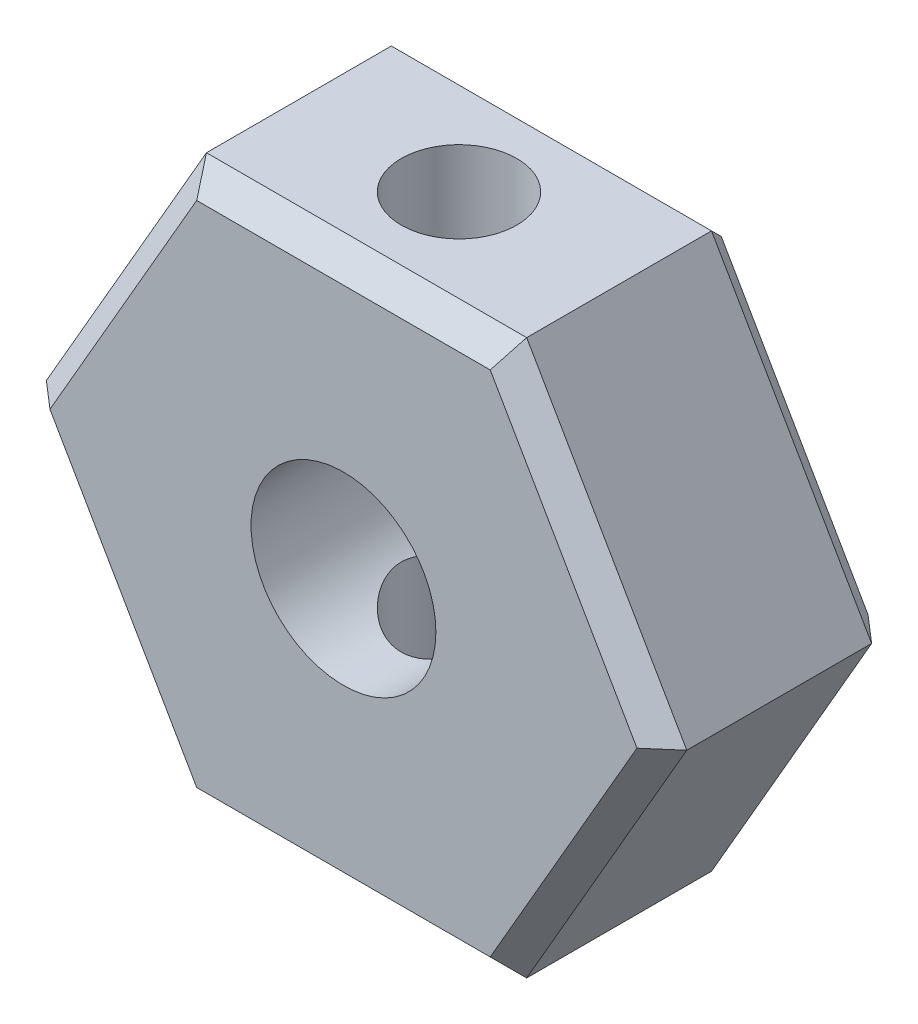
ISO-10303-21;
HEADER;
FILE_DESCRIPTION(('STEP AP214'),'2;1');
FILE_NAME('part.step','',(''),(''),'','','');
FILE_SCHEMA(('AUTOMOTIVE_DESIGN { 1 0 10303 214 1 1 1 1 }'));
ENDSEC;
DATA;
#1=APPLICATION_CONTEXT('core data for automotive mechanical design processes');
#2=APPLICATION_PROTOCOL_DEFINITION('international standard','automotive_design',2000,#1);
#3=PRODUCT_CONTEXT('',#1,'mechanical');
#4=PRODUCT('Part','Part','',(#3));
#5=PRODUCT_RELATED_PRODUCT_CATEGORY('part','',(#4));
#6=PRODUCT_DEFINITION_FORMATION('','',#4);
#7=PRODUCT_DEFINITION_CONTEXT('part definition',#1,'design');
#8=PRODUCT_DEFINITION('design','',#6,#7);
#9=PRODUCT_DEFINITION_SHAPE('','',#8);
#10=(LENGTH_UNIT() NAMED_UNIT(*) SI_UNIT(.MILLI.,.METRE.));
#11=(NAMED_UNIT(*) PLANE_ANGLE_UNIT() SI_UNIT($,.RADIAN.));
#12=(NAMED_UNIT(*) SI_UNIT($,.STERADIAN.) SOLID_ANGLE_UNIT());
#13=UNCERTAINTY_MEASURE_WITH_UNIT(LENGTH_MEASURE(1.E-05),#10,'distance_accuracy_value','');
#14=(GEOMETRIC_REPRESENTATION_CONTEXT(3) GLOBAL_UNCERTAINTY_ASSIGNED_CONTEXT((#13)) GLOBAL_UNIT_ASSIGNED_CONTEXT((#10,
#11,#12)) REPRESENTATION_CONTEXT('',''));
#15=CARTESIAN_POINT('',(0.,0.,0.));
#16=DIRECTION('',(0.,0.,1.));
#17=DIRECTION('',(1.,0.,0.));
#18=AXIS2_PLACEMENT_3D('',#15,#16,#17);
#19=CARTESIAN_POINT('',(3.46410161513776,-6.,5.));
#20=DIRECTION('',(-0.866025403784439,0.5,0.));
#21=DIRECTION('',(-0.5,-0.866025403784439,0.));
#22=AXIS2_PLACEMENT_3D('',#19,#20,#21);
#23=PLANE('',#22);
#24=DIRECTION('',(0.,0.,-1.));
#25=VECTOR('',#24,1.);
#26=CARTESIAN_POINT('',(3.46410161513776,-6.,5.));
#27=LINE('',#26,#25);
#28=CARTESIAN_POINT('',(3.46410161513776,-6.,4.49999999999999));
#29=VERTEX_POINT('',#28);
#30=CARTESIAN_POINT('',(3.46410161513776,-6.,0.499999999999998));
#31=VERTEX_POINT('',#30);
#32=EDGE_CURVE('E150',#29,#31,#27,.T.);
#33=ORIENTED_EDGE('',*,*,#32,.T.);
#34=DIRECTION('',(0.5,0.866025403784439,0.));
#35=VECTOR('',#34,1.);
#36=CARTESIAN_POINT('',(3.46410161513776,-6.,0.499999999999998));
#37=LINE('',#36,#35);
#38=CARTESIAN_POINT('',(6.92820323027551,0.,0.499999999999996));
#39=VERTEX_POINT('',#38);
#40=EDGE_CURVE('E152',#31,#39,#37,.T.);
#41=ORIENTED_EDGE('',*,*,#40,.T.);
#42=DIRECTION('',(0.,0.,-1.));
#43=VECTOR('',#42,1.);
#44=CARTESIAN_POINT('',(6.92820323027551,0.,5.));
#45=LINE('',#44,#43);
#46=CARTESIAN_POINT('',(6.92820323027551,0.,4.49999999999999));
#47=VERTEX_POINT('',#46);
#48=EDGE_CURVE('E145',#47,#39,#45,.T.);
#49=ORIENTED_EDGE('',*,*,#48,.F.);
#50=DIRECTION('',(-0.5,-0.866025403784439,0.));
#51=VECTOR('',#50,1.);
#52=CARTESIAN_POINT('',(3.46410161513776,-6.,4.49999999999999));
#53=LINE('',#52,#51);
#54=EDGE_CURVE('E130',#47,#29,#53,.T.);
#55=ORIENTED_EDGE('',*,*,#54,.T.);
#56=EDGE_LOOP('',(#33,#41,#49,#55));
#57=FACE_BOUND('',#56,.T.);
#58=ADVANCED_FACE('F33',(#57),#23,.F.);
#59=CARTESIAN_POINT('',(6.92820323027551,0.,5.));
#60=DIRECTION('',(-0.866025403784439,-0.5,0.));
#61=DIRECTION('',(0.5,-0.866025403784439,0.));
#62=AXIS2_PLACEMENT_3D('',#59,#60,#61);
#63=PLANE('',#62);
#64=ORIENTED_EDGE('',*,*,#48,.T.);
#65=DIRECTION('',(-0.5,0.866025403784439,0.));
#66=VECTOR('',#65,1.);
#67=CARTESIAN_POINT('',(6.92820323027551,0.,0.499999999999996));
#68=LINE('',#67,#66);
#69=CARTESIAN_POINT('',(3.46410161513776,6.,0.499999999999996));
#70=VERTEX_POINT('',#69);
#71=EDGE_CURVE('E205',#39,#70,#68,.T.);
#72=ORIENTED_EDGE('',*,*,#71,.T.);
#73=DIRECTION('',(0.,0.,-1.));
#74=VECTOR('',#73,1.);
#75=CARTESIAN_POINT('',(3.46410161513776,6.,5.));
#76=LINE('',#75,#74);
#77=CARTESIAN_POINT('',(3.46410161513776,6.,4.49999999999999));
#78=VERTEX_POINT('',#77);
#79=EDGE_CURVE('E173',#78,#70,#76,.T.);
#80=ORIENTED_EDGE('',*,*,#79,.F.);
#81=DIRECTION('',(0.5,-0.866025403784439,0.));
#82=VECTOR('',#81,1.);
#83=CARTESIAN_POINT('',(6.92820323027551,0.,4.49999999999999));
#84=LINE('',#83,#82);
#85=EDGE_CURVE('E203',#78,#47,#84,.T.);
#86=ORIENTED_EDGE('',*,*,#85,.T.);
#87=EDGE_LOOP('',(#64,#72,#80,#86));
#88=FACE_BOUND('',#87,.T.);
#89=ADVANCED_FACE('F261',(#88),#63,.F.);
#90=CARTESIAN_POINT('',(3.46410161513776,6.,5.));
#91=DIRECTION('',(0.,-1.,0.));
#92=DIRECTION('',(1.,0.,0.));
#93=AXIS2_PLACEMENT_3D('',#90,#91,#92);
#94=PLANE('',#93);
#95=CARTESIAN_POINT('',(0.,6.,2.5));
#96=DIRECTION('',(0.,1.,0.));
#97=DIRECTION('',(-1.,0.,0.));
#98=AXIS2_PLACEMENT_3D('',#95,#96,#97);
#99=CIRCLE('',#98,1.25);
#100=CARTESIAN_POINT('',(-1.25,6.,2.5));
#101=VERTEX_POINT('',#100);
#102=EDGE_CURVE('E385',#101,#101,#99,.T.);
#103=ORIENTED_EDGE('',*,*,#102,.F.);
#104=EDGE_LOOP('',(#103));
#105=FACE_BOUND('',#104,.T.);
#106=ORIENTED_EDGE('',*,*,#79,.T.);
#107=DIRECTION('',(-1.,0.,0.));
#108=VECTOR('',#107,1.);
#109=CARTESIAN_POINT('',(3.46410161513776,6.,0.499999999999997));
#110=LINE('',#109,#108);
#111=CARTESIAN_POINT('',(-3.46410161513776,6.,0.499999999999997));
#112=VERTEX_POINT('',#111);
#113=EDGE_CURVE('E201',#70,#112,#110,.T.);
#114=ORIENTED_EDGE('',*,*,#113,.T.);
#115=DIRECTION('',(0.,0.,-1.));
#116=VECTOR('',#115,1.);
#117=CARTESIAN_POINT('',(-3.46410161513776,6.,5.));
#118=LINE('',#117,#116);
#119=CARTESIAN_POINT('',(-3.46410161513776,6.,4.49999999999999));
#120=VERTEX_POINT('',#119);
#121=EDGE_CURVE('E170',#120,#112,#118,.T.);
#122=ORIENTED_EDGE('',*,*,#121,.F.);
#123=DIRECTION('',(1.,0.,0.));
#124=VECTOR('',#123,1.);
#125=CARTESIAN_POINT('',(3.46410161513776,6.,4.49999999999999));
#126=LINE('',#125,#124);
#127=EDGE_CURVE('E199',#120,#78,#126,.T.);
#128=ORIENTED_EDGE('',*,*,#127,.T.);
#129=EDGE_LOOP('',(#106,#114,#122,#128));
#130=FACE_BOUND('',#129,.T.);
#131=ADVANCED_FACE('F266',(#105,#130),#94,.F.);
#132=CARTESIAN_POINT('',(-3.46410161513776,6.,5.));
#133=DIRECTION('',(0.866025403784439,-0.5,0.));
#134=DIRECTION('',(0.5,0.866025403784439,0.));
#135=AXIS2_PLACEMENT_3D('',#132,#133,#134);
#136=PLANE('',#135);
#137=ORIENTED_EDGE('',*,*,#121,.T.);
#138=DIRECTION('',(-0.5,-0.866025403784439,0.));
#139=VECTOR('',#138,1.);
#140=CARTESIAN_POINT('',(-3.46410161513776,6.,0.499999999999997));
#141=LINE('',#140,#139);
#142=CARTESIAN_POINT('',(-6.92820323027551,0.,0.499999999999997));
#143=VERTEX_POINT('',#142);
#144=EDGE_CURVE('E197',#112,#143,#141,.T.);
#145=ORIENTED_EDGE('',*,*,#144,.T.);
#146=DIRECTION('',(0.,0.,-1.));
#147=VECTOR('',#146,1.);
#148=CARTESIAN_POINT('',(-6.92820323027551,0.,5.));
#149=LINE('',#148,#147);
#150=CARTESIAN_POINT('',(-6.92820323027551,0.,4.49999999999999));
#151=VERTEX_POINT('',#150);
#152=EDGE_CURVE('E161',#151,#143,#149,.T.);
#153=ORIENTED_EDGE('',*,*,#152,.F.);
#154=DIRECTION('',(0.5,0.866025403784439,0.));
#155=VECTOR('',#154,1.);
#156=CARTESIAN_POINT('',(-3.46410161513776,6.,4.49999999999999));
#157=LINE('',#156,#155);
#158=EDGE_CURVE('E195',#151,#120,#157,.T.);
#159=ORIENTED_EDGE('',*,*,#158,.T.);
#160=EDGE_LOOP('',(#137,#145,#153,#159));
#161=FACE_BOUND('',#160,.T.);
#162=ADVANCED_FACE('F322',(#161),#136,.F.);
#163=CARTESIAN_POINT('',(-6.92820323027551,0.,5.));
#164=DIRECTION('',(0.866025403784438,0.5,0.));
#165=DIRECTION('',(-0.5,0.866025403784439,0.));
#166=AXIS2_PLACEMENT_3D('',#163,#164,#165);
#167=PLANE('',#166);
#168=ORIENTED_EDGE('',*,*,#152,.T.);
#169=DIRECTION('',(0.5,-0.866025403784439,0.));
#170=VECTOR('',#169,1.);
#171=CARTESIAN_POINT('',(-6.92820323027551,0.,0.499999999999998));
#172=LINE('',#171,#170);
#173=CARTESIAN_POINT('',(-3.46410161513775,-6.,0.499999999999998));
#174=VERTEX_POINT('',#173);
#175=EDGE_CURVE('E193',#143,#174,#172,.T.);
#176=ORIENTED_EDGE('',*,*,#175,.T.);
#177=DIRECTION('',(0.,0.,-1.));
#178=VECTOR('',#177,1.);
#179=CARTESIAN_POINT('',(-3.46410161513775,-6.,5.));
#180=LINE('',#179,#178);
#181=CARTESIAN_POINT('',(-3.46410161513775,-6.,4.49999999999999));
#182=VERTEX_POINT('',#181);
#183=EDGE_CURVE('E158',#182,#174,#180,.T.);
#184=ORIENTED_EDGE('',*,*,#183,.F.);
#185=DIRECTION('',(-0.5,0.866025403784439,0.));
#186=VECTOR('',#185,1.);
#187=CARTESIAN_POINT('',(-6.92820323027551,0.,4.49999999999999));
#188=LINE('',#187,#186);
#189=EDGE_CURVE('E191',#182,#151,#188,.T.);
#190=ORIENTED_EDGE('',*,*,#189,.T.);
#191=EDGE_LOOP('',(#168,#176,#184,#190));
#192=FACE_BOUND('',#191,.T.);
#193=ADVANCED_FACE('F342',(#192),#167,.F.);
#194=CARTESIAN_POINT('',(-3.46410161513775,-6.,5.));
#195=DIRECTION('',(0.,1.,0.));
#196=DIRECTION('',(0.,0.,1.));
#197=AXIS2_PLACEMENT_3D('',#194,#195,#196);
#198=PLANE('',#197);
#199=CARTESIAN_POINT('',(0.,-6.00000000000001,2.5));
#200=DIRECTION('',(0.,1.,0.));
#201=DIRECTION('',(-1.,0.,0.));
#202=AXIS2_PLACEMENT_3D('',#199,#200,#201);
#203=CIRCLE('',#202,1.25);
#204=CARTESIAN_POINT('',(-1.25,-6.00000000000001,2.5));
#205=VERTEX_POINT('',#204);
#206=EDGE_CURVE('E244',#205,#205,#203,.T.);
#207=ORIENTED_EDGE('',*,*,#206,.T.);
#208=EDGE_LOOP('',(#207));
#209=FACE_BOUND('',#208,.T.);
#210=ORIENTED_EDGE('',*,*,#183,.T.);
#211=DIRECTION('',(1.,0.,0.));
#212=VECTOR('',#211,1.);
#213=CARTESIAN_POINT('',(-3.46410161513775,-6.,0.499999999999997));
#214=LINE('',#213,#212);
#215=EDGE_CURVE('E144',#174,#31,#214,.T.);
#216=ORIENTED_EDGE('',*,*,#215,.T.);
#217=ORIENTED_EDGE('',*,*,#32,.F.);
#218=DIRECTION('',(-1.,0.,0.));
#219=VECTOR('',#218,1.);
#220=CARTESIAN_POINT('',(-3.46410161513775,-6.,4.49999999999999));
#221=LINE('',#220,#219);
#222=EDGE_CURVE('E137',#29,#182,#221,.T.);
#223=ORIENTED_EDGE('',*,*,#222,.T.);
#224=EDGE_LOOP('',(#210,#216,#217,#223));
#225=FACE_BOUND('',#224,.T.);
#226=ADVANCED_FACE('F156',(#209,#225),#198,.F.);
#227=CARTESIAN_POINT('',(0.,0.,5.));
#228=DIRECTION('',(0.,0.,1.));
#229=DIRECTION('',(1.,0.,0.));
#230=AXIS2_PLACEMENT_3D('',#227,#228,#229);
#231=PLANE('',#230);
#232=DIRECTION('',(1.,0.,0.));
#233=VECTOR('',#232,1.);
#234=CARTESIAN_POINT('',(3.46410161513776,-5.5,5.));
#235=LINE('',#234,#233);
#236=CARTESIAN_POINT('',(-3.17542648054294,-5.5,5.));
#237=VERTEX_POINT('',#236);
#238=CARTESIAN_POINT('',(3.17542648054294,-5.5,5.));
#239=VERTEX_POINT('',#238);
#240=EDGE_CURVE('E46',#237,#239,#235,.T.);
#241=ORIENTED_EDGE('',*,*,#240,.T.);
#242=DIRECTION('',(0.5,0.866025403784439,0.));
#243=VECTOR('',#242,1.);
#244=CARTESIAN_POINT('',(6.49519052838329,0.250000000000003,5.));
#245=LINE('',#244,#243);
#246=CARTESIAN_POINT('',(6.35085296108589,0.,5.));
#247=VERTEX_POINT('',#246);
#248=EDGE_CURVE('E11',#239,#247,#245,.T.);
#249=ORIENTED_EDGE('',*,*,#248,.T.);
#250=DIRECTION('',(-0.5,0.866025403784439,0.));
#251=VECTOR('',#250,1.);
#252=CARTESIAN_POINT('',(3.03108891324554,5.75,5.));
#253=LINE('',#252,#251);
#254=CARTESIAN_POINT('',(3.17542648054294,5.5,5.));
#255=VERTEX_POINT('',#254);
#256=EDGE_CURVE('E207',#247,#255,#253,.T.);
#257=ORIENTED_EDGE('',*,*,#256,.T.);
#258=DIRECTION('',(-1.,0.,0.));
#259=VECTOR('',#258,1.);
#260=CARTESIAN_POINT('',(-3.46410161513776,5.5,5.));
#261=LINE('',#260,#259);
#262=CARTESIAN_POINT('',(-3.17542648054295,5.5,5.));
#263=VERTEX_POINT('',#262);
#264=EDGE_CURVE('E209',#255,#263,#261,.T.);
#265=ORIENTED_EDGE('',*,*,#264,.T.);
#266=DIRECTION('',(-0.5,-0.866025403784439,0.));
#267=VECTOR('',#266,1.);
#268=CARTESIAN_POINT('',(-6.49519052838329,-0.250000000000002,5.));
#269=LINE('',#268,#267);
#270=CARTESIAN_POINT('',(-6.35085296108588,0.,5.));
#271=VERTEX_POINT('',#270);
#272=EDGE_CURVE('E211',#263,#271,#269,.T.);
#273=ORIENTED_EDGE('',*,*,#272,.T.);
#274=DIRECTION('',(0.5,-0.866025403784439,0.));
#275=VECTOR('',#274,1.);
#276=CARTESIAN_POINT('',(-3.03108891324553,-5.75,5.));
#277=LINE('',#276,#275);
#278=EDGE_CURVE('E57',#271,#237,#277,.T.);
#279=ORIENTED_EDGE('',*,*,#278,.T.);
#280=EDGE_LOOP('',(#241,#249,#257,#265,#273,#279));
#281=FACE_BOUND('',#280,.T.);
#282=CARTESIAN_POINT('',(0.,0.,5.));
#283=DIRECTION('',(0.,0.,1.));
#284=DIRECTION('',(1.,0.,0.));
#285=AXIS2_PLACEMENT_3D('',#282,#283,#284);
#286=CIRCLE('',#285,2.);
#287=CARTESIAN_POINT('',(2.,0.,5.));
#288=VERTEX_POINT('',#287);
#289=EDGE_CURVE('E164',#288,#288,#286,.T.);
#290=ORIENTED_EDGE('',*,*,#289,.F.);
#291=EDGE_LOOP('',(#290));
#292=FACE_BOUND('',#291,.T.);
#293=ADVANCED_FACE('F351',(#281,#292),#231,.T.);
#294=CARTESIAN_POINT('',(0.,0.,0.));
#295=DIRECTION('',(0.,0.,1.));
#296=DIRECTION('',(1.,0.,0.));
#297=AXIS2_PLACEMENT_3D('',#294,#295,#296);
#298=PLANE('',#297);
#299=DIRECTION('',(-0.5,-0.866025403784439,0.));
#300=VECTOR('',#299,1.);
#301=CARTESIAN_POINT('',(4.76313972081442,-2.75,0.));
#302=LINE('',#301,#300);
#303=CARTESIAN_POINT('',(6.35085296108589,0.,0.));
#304=VERTEX_POINT('',#303);
#305=CARTESIAN_POINT('',(3.17542648054294,-5.5,0.));
#306=VERTEX_POINT('',#305);
#307=EDGE_CURVE('E186',#304,#306,#302,.T.);
#308=ORIENTED_EDGE('',*,*,#307,.T.);
#309=DIRECTION('',(-1.,0.,0.));
#310=VECTOR('',#309,1.);
#311=CARTESIAN_POINT('',(0.,-5.5,0.));
#312=LINE('',#311,#310);
#313=CARTESIAN_POINT('',(-3.17542648054294,-5.5,0.));
#314=VERTEX_POINT('',#313);
#315=EDGE_CURVE('E153',#306,#314,#312,.T.);
#316=ORIENTED_EDGE('',*,*,#315,.T.);
#317=DIRECTION('',(-0.5,0.866025403784439,0.));
#318=VECTOR('',#317,1.);
#319=CARTESIAN_POINT('',(-4.76313972081442,-2.75,0.));
#320=LINE('',#319,#318);
#321=CARTESIAN_POINT('',(-6.35085296108589,0.,0.));
#322=VERTEX_POINT('',#321);
#323=EDGE_CURVE('E184',#314,#322,#320,.T.);
#324=ORIENTED_EDGE('',*,*,#323,.T.);
#325=DIRECTION('',(0.5,0.866025403784439,0.));
#326=VECTOR('',#325,1.);
#327=CARTESIAN_POINT('',(-4.76313972081442,2.75,0.));
#328=LINE('',#327,#326);
#329=CARTESIAN_POINT('',(-3.17542648054295,5.5,0.));
#330=VERTEX_POINT('',#329);
#331=EDGE_CURVE('E182',#322,#330,#328,.T.);
#332=ORIENTED_EDGE('',*,*,#331,.T.);
#333=DIRECTION('',(1.,0.,0.));
#334=VECTOR('',#333,1.);
#335=CARTESIAN_POINT('',(0.,5.5,0.));
#336=LINE('',#335,#334);
#337=CARTESIAN_POINT('',(3.17542648054294,5.5,0.));
#338=VERTEX_POINT('',#337);
#339=EDGE_CURVE('E180',#330,#338,#336,.T.);
#340=ORIENTED_EDGE('',*,*,#339,.T.);
#341=DIRECTION('',(0.5,-0.866025403784439,0.));
#342=VECTOR('',#341,1.);
#343=CARTESIAN_POINT('',(4.76313972081442,2.75,0.));
#344=LINE('',#343,#342);
#345=EDGE_CURVE('E178',#338,#304,#344,.T.);
#346=ORIENTED_EDGE('',*,*,#345,.T.);
#347=EDGE_LOOP('',(#308,#316,#324,#332,#340,#346));
#348=FACE_BOUND('',#347,.T.);
#349=CARTESIAN_POINT('',(0.,0.,0.));
#350=DIRECTION('',(0.,0.,1.));
#351=DIRECTION('',(1.,0.,0.));
#352=AXIS2_PLACEMENT_3D('',#349,#350,#351);
#353=CIRCLE('',#352,2.);
#354=CARTESIAN_POINT('',(2.,0.,0.));
#355=VERTEX_POINT('',#354);
#356=EDGE_CURVE('E159',#355,#355,#353,.T.);
#357=ORIENTED_EDGE('',*,*,#356,.T.);
#358=EDGE_LOOP('',(#357));
#359=FACE_BOUND('',#358,.T.);
#360=ADVANCED_FACE('F335',(#348,#359),#298,.F.);
#361=CARTESIAN_POINT('',(0.,0.,0.));
#362=DIRECTION('',(0.,0.,1.));
#363=DIRECTION('',(1.,0.,0.));
#364=AXIS2_PLACEMENT_3D('',#361,#362,#363);
#365=CYLINDRICAL_SURFACE('',#364,2.);
#366=CARTESIAN_POINT('',(-1.25,-1.5612494995996,2.5));
#367=CARTESIAN_POINT('',(-1.24999462210485,-1.56125800072558,2.43787971819707));
#368=CARTESIAN_POINT('',(-1.24532693849665,-1.56502642708837,2.37566216462974));
#369=CARTESIAN_POINT('',(-1.22698950832934,-1.57943717205478,2.25332367992062));
#370=CARTESIAN_POINT('',(-1.21329530430551,-1.59009816464115,2.19320891363476));
#371=CARTESIAN_POINT('',(-1.17788073911871,-1.61650085329041,2.07721767730115));
#372=CARTESIAN_POINT('',(-1.15622993332784,-1.63219837418033,2.02130939131818));
#373=CARTESIAN_POINT('',(-1.10571945561924,-1.66682950714432,1.91399113836184));
#374=CARTESIAN_POINT('',(-1.07685958706091,-1.68576320748676,1.86258129414349));
#375=CARTESIAN_POINT('',(-1.00823937928364,-1.72779611374711,1.75813484552301));
#376=CARTESIAN_POINT('',(-0.967536093692501,-1.75111338227346,1.7058052591674));
#377=CARTESIAN_POINT('',(-0.878308664496878,-1.79752820854877,1.60811730085503));
#378=CARTESIAN_POINT('',(-0.829777781297412,-1.82062555863329,1.56276500271607));
#379=CARTESIAN_POINT('',(-0.719186665258489,-1.86729453891009,1.47489641485187));
#380=CARTESIAN_POINT('',(-0.656200568910555,-1.8905872224145,1.43338233189569));
#381=CARTESIAN_POINT('',(-0.522404070837314,-1.9318323169914,1.36187479523684));
#382=CARTESIAN_POINT('',(-0.45160150647824,-1.94979001179838,1.33186993424874));
#383=CARTESIAN_POINT('',(-0.311776878362017,-1.97669841318201,1.28751768939293));
#384=CARTESIAN_POINT('',(-0.243305636047239,-1.98637922422038,1.27188858360306));
#385=CARTESIAN_POINT('',(-0.104105100662262,-1.99850544379202,1.25236793035659));
#386=CARTESIAN_POINT('',(-0.0333782605640252,-2.00095845843657,1.24846404387944));
#387=CARTESIAN_POINT('',(0.098065828421342,-1.99852909107528,1.25235568927761));
#388=CARTESIAN_POINT('',(0.158852523273788,-1.99458699811902,1.2586513763009));
#389=CARTESIAN_POINT('',(0.278306645903671,-1.98145272261225,1.27986698436332));
#390=CARTESIAN_POINT('',(0.336973913146976,-1.97226014325117,1.29478755723751));
#391=CARTESIAN_POINT('',(0.450889117077074,-1.94938133614675,1.33260377509711));
#392=CARTESIAN_POINT('',(0.506127875493235,-1.93568361673912,1.35551982404859));
#393=CARTESIAN_POINT('',(0.612019220469384,-1.90485632889331,1.40846875525999));
#394=CARTESIAN_POINT('',(0.662670758560003,-1.88772597874226,1.4385032588906));
#395=CARTESIAN_POINT('',(0.764713515567043,-1.84893224750793,1.50902816532936));
#396=CARTESIAN_POINT('',(0.815412344918951,-1.82697004307144,1.55035462674233));
#397=CARTESIAN_POINT('',(0.9095985959055,-1.78195462752237,1.64013238022337));
#398=CARTESIAN_POINT('',(0.953075338789634,-1.75889986449171,1.68859402644654));
#399=CARTESIAN_POINT('',(1.03735445892932,-1.71071442112195,1.7987056229061));
#400=CARTESIAN_POINT('',(1.07706615479947,-1.68570581533195,1.8612513808503));
#401=CARTESIAN_POINT('',(1.14526153203309,-1.64014139095399,1.99364611977342));
#402=CARTESIAN_POINT('',(1.17376589603358,-1.61957740191679,2.06348134395541));
#403=CARTESIAN_POINT('',(1.21218566853166,-1.5909187656712,2.18976940288787));
#404=CARTESIAN_POINT('',(1.22501841721721,-1.58096704305272,2.24491096263767));
#405=CARTESIAN_POINT('',(1.24310168537523,-1.56679138875765,2.35711518874893));
#406=CARTESIAN_POINT('',(1.24836256353275,-1.56255963237428,2.41417512103989));
#407=CARTESIAN_POINT('',(1.25098535954508,-1.56046133530164,2.52872868054027));
#408=CARTESIAN_POINT('',(1.24832917576576,-1.56260938140435,2.58622300136582));
#409=CARTESIAN_POINT('',(1.23525733555987,-1.57296042862705,2.6997805810316));
#410=CARTESIAN_POINT('',(1.22483525320262,-1.58116844404656,2.75584261496292));
#411=CARTESIAN_POINT('',(1.1970493572483,-1.60230060601957,2.8642183838658));
#412=CARTESIAN_POINT('',(1.17980280626788,-1.61514477937171,2.91657867333151));
#413=CARTESIAN_POINT('',(1.13902451938523,-1.64415573440841,3.01778733455698));
#414=CARTESIAN_POINT('',(1.11549055271421,-1.66032369489908,3.06663445202449));
#415=CARTESIAN_POINT('',(1.0576537677232,-1.69787203988937,3.16930603917703));
#416=CARTESIAN_POINT('',(1.02215373814221,-1.71965875738289,3.22230754124932));
#417=CARTESIAN_POINT('',(0.943690263224863,-1.76393958000711,3.32218505243914));
#418=CARTESIAN_POINT('',(0.900719074496601,-1.78643439903354,3.36905461697796));
#419=CARTESIAN_POINT('',(0.800380659499195,-1.83383164018972,3.46298324624315));
#420=CARTESIAN_POINT('',(0.741809949714164,-1.85854204787597,3.50886855700767));
#421=CARTESIAN_POINT('',(0.616299987869578,-1.90384248964999,3.59006865187585));
#422=CARTESIAN_POINT('',(0.549364678748662,-1.92443445329133,3.62538838997364));
#423=CARTESIAN_POINT('',(0.4129259006366,-1.95809255957561,3.68199499120263));
#424=CARTESIAN_POINT('',(0.343814822544519,-1.9715348458918,3.70399420647076));
#425=CARTESIAN_POINT('',(0.201860998884746,-1.9910701008804,3.73572666868108));
#426=CARTESIAN_POINT('',(0.129023563238367,-1.99717323933003,3.74547688976111));
#427=CARTESIAN_POINT('',(-0.00659907199681211,-2.00096685748559,3.75154652003878));
#428=CARTESIAN_POINT('',(-0.0692812975954738,-1.99976600623617,3.74963577678698));
#429=CARTESIAN_POINT('',(-0.193279811091725,-1.99160739958772,3.73653832502566));
#430=CARTESIAN_POINT('',(-0.254596160840743,-1.98464990541518,3.72535203742423));
#431=CARTESIAN_POINT('',(-0.372043294685526,-1.9659610468898,3.6948395251234));
#432=CARTESIAN_POINT('',(-0.428280180678309,-1.95440367471701,3.67580916012679));
#433=CARTESIAN_POINT('',(-0.536714369111315,-1.92744968677265,3.63044007183593));
#434=CARTESIAN_POINT('',(-0.58891098811824,-1.91205242331406,3.60410011552441));
#435=CARTESIAN_POINT('',(-0.693656737470666,-1.87675342239825,3.54183942100879));
#436=CARTESIAN_POINT('',(-0.745680127162211,-1.85655002466956,3.50520801868101));
#437=CARTESIAN_POINT('',(-0.843216608355413,-1.81433640456238,3.4249233696673));
#438=CARTESIAN_POINT('',(-0.88872224305523,-1.7923241573062,3.38126219975405));
#439=CARTESIAN_POINT('',(-0.978723601300805,-1.74500415099525,3.28088373769672));
#440=CARTESIAN_POINT('',(-1.02212829873816,-1.71967871446314,3.22319165482308));
#441=CARTESIAN_POINT('',(-1.09877325005744,-1.67174821497037,3.10035533398988));
#442=CARTESIAN_POINT('',(-1.132019125571,-1.64914165167051,3.0352152450924));
#443=CARTESIAN_POINT('',(-1.18099110923231,-1.61429776080214,2.91359723207033));
#444=CARTESIAN_POINT('',(-1.19896216276381,-1.60087340349652,2.85836431912063));
#445=CARTESIAN_POINT('',(-1.22712822180407,-1.57939158437939,2.7450307220428));
#446=CARTESIAN_POINT('',(-1.23734784245404,-1.57131714400176,2.68693974497585));
#447=CARTESIAN_POINT('',(-1.24559906183097,-1.56476456389394,2.60696947613714));
#448=CARTESIAN_POINT('',(-1.24724671259581,-1.56345069546827,2.58563585448301));
#449=CARTESIAN_POINT('',(-1.24944824734288,-1.56169158695047,2.54287203347851));
#450=CARTESIAN_POINT('',(-1.25000185626673,-1.56124656529967,2.52144181119831));
#451=CARTESIAN_POINT('',(-1.25,-1.5612494995996,2.5));
#452=B_SPLINE_CURVE_WITH_KNOTS('',3,(#366,#367,#368,#369,#370,#371,#372,#373,#374,#375,#376,
#377,#378,#379,#380,#381,#382,#383,#384,#385,#386,#387,#388,#389,#390,#391,#392,#393,#394,#395,
#396,#397,#398,#399,#400,#401,#402,#403,#404,#405,#406,#407,#408,#409,#410,#411,#412,#413,#414,
#415,#416,#417,#418,#419,#420,#421,#422,#423,#424,#425,#426,#427,#428,#429,#430,#431,#432,#433,
#434,#435,#436,#437,#438,#439,#440,#441,#442,#443,#444,#445,#446,#447,#448,#449,#450,#451),
.UNSPECIFIED.,.T.,.F.,(4,2,2,2,2,2,2,2,2,2,2,2,2,2,2,2,2,2,2,2,2,2,2,2,2,2,2,2,2,2,2,2,2,2,2,2,
2,2,2,2,2,2,4),(0.,0.186262444012015,0.373031654397096,0.558205556130402,0.743384509377751,
0.953406207440074,1.16360970997911,1.39917236034457,1.6345009273926,1.84590412815398,
2.05708478092387,2.23992319583511,2.42277543076414,2.60609774825956,2.78946186128171,
2.99564504832107,3.20213044016186,3.43558067920821,3.66859805095278,3.84032775480268,
4.01182230007289,4.18370925240739,4.35573859160081,4.52493212343598,4.69418576487135,
4.89566333610129,5.09735098485254,5.33136598660889,5.56527109061626,5.78520080494549,
6.00482541258961,6.19203601525124,6.37923812308583,6.55994569114424,6.74068376037881,
6.94018144108746,7.13990556958868,7.36841817421249,7.59680409585386,7.77496902270413,
7.95256577963385,8.01684109069498,8.08113255947023),.UNSPECIFIED.);
#453=CARTESIAN_POINT('',(-1.25,-1.5612494995996,2.5));
#454=VERTEX_POINT('',#453);
#455=EDGE_CURVE('E37',#454,#454,#452,.T.);
#456=ORIENTED_EDGE('',*,*,#455,.T.);
#457=EDGE_LOOP('',(#456));
#458=FACE_BOUND('',#457,.T.);
#459=CARTESIAN_POINT('',(-1.25,1.5612494995996,2.5));
#460=CARTESIAN_POINT('',(-1.24999462210485,1.56125800072559,2.56212028180293));
#461=CARTESIAN_POINT('',(-1.24532693849666,1.56502642708837,2.62433783537025));
#462=CARTESIAN_POINT('',(-1.22698950832934,1.57943717205478,2.74667632007937));
#463=CARTESIAN_POINT('',(-1.21329530430551,1.59009816464115,2.80679108636523));
#464=CARTESIAN_POINT('',(-1.17788073911871,1.61650085329041,2.92278232269884));
#465=CARTESIAN_POINT('',(-1.15622993332784,1.63219837418033,2.97869060868181));
#466=CARTESIAN_POINT('',(-1.10571945561924,1.66682950714432,3.08600886163815));
#467=CARTESIAN_POINT('',(-1.07685958706091,1.68576320748676,3.1374187058565));
#468=CARTESIAN_POINT('',(-1.00823937928364,1.72779611374711,3.24186515447698));
#469=CARTESIAN_POINT('',(-0.967536093692502,1.75111338227346,3.29419474083259));
#470=CARTESIAN_POINT('',(-0.878308664496879,1.79752820854877,3.39188269914496));
#471=CARTESIAN_POINT('',(-0.829777781297413,1.82062555863329,3.43723499728392));
#472=CARTESIAN_POINT('',(-0.719186665258491,1.86729453891009,3.52510358514812));
#473=CARTESIAN_POINT('',(-0.656200568910556,1.8905872224145,3.5666176681043));
#474=CARTESIAN_POINT('',(-0.522404070837315,1.9318323169914,3.63812520476316));
#475=CARTESIAN_POINT('',(-0.451601506478241,1.94979001179838,3.66813006575125));
#476=CARTESIAN_POINT('',(-0.311776878362018,1.97669841318201,3.71248231060706));
#477=CARTESIAN_POINT('',(-0.243305636047241,1.98637922422038,3.72811141639693));
#478=CARTESIAN_POINT('',(-0.104105100662263,1.99850544379202,3.7476320696434));
#479=CARTESIAN_POINT('',(-0.0333782605640266,2.00095845843657,3.75153595612055));
#480=CARTESIAN_POINT('',(0.0980658284213406,1.99852909107528,3.74764431072238));
#481=CARTESIAN_POINT('',(0.158852523273786,1.99458699811902,3.74134862369909));
#482=CARTESIAN_POINT('',(0.27830664590367,1.98145272261225,3.72013301563667));
#483=CARTESIAN_POINT('',(0.336973913146974,1.97226014325117,3.70521244276248));
#484=CARTESIAN_POINT('',(0.450889117077073,1.94938133614675,3.66739622490288));
#485=CARTESIAN_POINT('',(0.506127875493233,1.93568361673912,3.64448017595141));
#486=CARTESIAN_POINT('',(0.612019220469382,1.90485632889331,3.59153124474001));
#487=CARTESIAN_POINT('',(0.662670758560001,1.88772597874226,3.56149674110939));
#488=CARTESIAN_POINT('',(0.764713515567042,1.84893224750793,3.49097183467063));
#489=CARTESIAN_POINT('',(0.81541234491895,1.82697004307144,3.44964537325766));
#490=CARTESIAN_POINT('',(0.909598595905499,1.78195462752237,3.35986761977662));
#491=CARTESIAN_POINT('',(0.953075338789632,1.75889986449171,3.31140597355345));
#492=CARTESIAN_POINT('',(1.03735445892932,1.71071442112195,3.20129437709389));
#493=CARTESIAN_POINT('',(1.07706615479946,1.68570581533195,3.13874861914969));
#494=CARTESIAN_POINT('',(1.14526153203309,1.64014139095399,3.00635388022657));
#495=CARTESIAN_POINT('',(1.17376589603358,1.6195774019168,2.93651865604458));
#496=CARTESIAN_POINT('',(1.21218566853166,1.5909187656712,2.81023059711212));
#497=CARTESIAN_POINT('',(1.22501841721721,1.58096704305272,2.75508903736232));
#498=CARTESIAN_POINT('',(1.24310168537523,1.56679138875765,2.64288481125106));
#499=CARTESIAN_POINT('',(1.24836256353275,1.56255963237428,2.5858248789601));
#500=CARTESIAN_POINT('',(1.25098535954508,1.56046133530164,2.47127131945973));
#501=CARTESIAN_POINT('',(1.24832917576576,1.56260938140435,2.41377699863418));
#502=CARTESIAN_POINT('',(1.23525733555987,1.57296042862705,2.30021941896839));
#503=CARTESIAN_POINT('',(1.22483525320262,1.58116844404657,2.24415738503707));
#504=CARTESIAN_POINT('',(1.1970493572483,1.60230060601957,2.13578161613419));
#505=CARTESIAN_POINT('',(1.17980280626788,1.61514477937171,2.08342132666848));
#506=CARTESIAN_POINT('',(1.13902451938523,1.64415573440841,1.98221266544302));
#507=CARTESIAN_POINT('',(1.11549055271421,1.66032369489908,1.9333655479755));
#508=CARTESIAN_POINT('',(1.0576537677232,1.69787203988937,1.83069396082297));
#509=CARTESIAN_POINT('',(1.02215373814221,1.71965875738289,1.77769245875067));
#510=CARTESIAN_POINT('',(0.943690263224863,1.76393958000711,1.67781494756085));
#511=CARTESIAN_POINT('',(0.900719074496601,1.78643439903354,1.63094538302203));
#512=CARTESIAN_POINT('',(0.800380659499194,1.83383164018972,1.53701675375684));
#513=CARTESIAN_POINT('',(0.741809949714164,1.85854204787597,1.49113144299232));
#514=CARTESIAN_POINT('',(0.616299987869578,1.90384248964999,1.40993134812414));
#515=CARTESIAN_POINT('',(0.549364678748663,1.92443445329133,1.37461161002636));
#516=CARTESIAN_POINT('',(0.4129259006366,1.95809255957561,1.31800500879736));
#517=CARTESIAN_POINT('',(0.34381482254452,1.9715348458918,1.29600579352923));
#518=CARTESIAN_POINT('',(0.201860998884747,1.9910701008804,1.26427333131891));
#519=CARTESIAN_POINT('',(0.129023563238367,1.99717323933003,1.25452311023888));
#520=CARTESIAN_POINT('',(-0.00659907199681228,2.00096685748559,1.24845347996121));
#521=CARTESIAN_POINT('',(-0.0692812975954743,1.99976600623617,1.25036422321301));
#522=CARTESIAN_POINT('',(-0.193279811091726,1.99160739958772,1.26346167497433));
#523=CARTESIAN_POINT('',(-0.254596160840743,1.98464990541518,1.27464796257576));
#524=CARTESIAN_POINT('',(-0.372043294685526,1.9659610468898,1.30516047487659));
#525=CARTESIAN_POINT('',(-0.428280180678309,1.95440367471701,1.3241908398732));
#526=CARTESIAN_POINT('',(-0.536714369111314,1.92744968677265,1.36955992816406));
#527=CARTESIAN_POINT('',(-0.588910988118239,1.91205242331406,1.39589988447558));
#528=CARTESIAN_POINT('',(-0.693656737470667,1.87675342239825,1.4581605789912));
#529=CARTESIAN_POINT('',(-0.745680127162212,1.85655002466956,1.49479198131898));
#530=CARTESIAN_POINT('',(-0.843216608355414,1.81433640456238,1.5750766303327));
#531=CARTESIAN_POINT('',(-0.88872224305523,1.7923241573062,1.61873780024594));
#532=CARTESIAN_POINT('',(-0.978723601300805,1.74500415099525,1.71911626230327));
#533=CARTESIAN_POINT('',(-1.02212829873816,1.71967871446314,1.77680834517691));
#534=CARTESIAN_POINT('',(-1.09877325005744,1.67174821497037,1.89964466601011));
#535=CARTESIAN_POINT('',(-1.132019125571,1.64914165167051,1.96478475490759));
#536=CARTESIAN_POINT('',(-1.18099110923231,1.61429776080214,2.08640276792966));
#537=CARTESIAN_POINT('',(-1.19896216276381,1.60087340349652,2.14163568087936));
#538=CARTESIAN_POINT('',(-1.22712822180408,1.57939158437939,2.25496927795719));
#539=CARTESIAN_POINT('',(-1.23734784245404,1.57131714400176,2.31306025502414));
#540=CARTESIAN_POINT('',(-1.24559906183097,1.56476456389394,2.39303052386285));
#541=CARTESIAN_POINT('',(-1.24724671259581,1.56345069546827,2.41436414551698));
#542=CARTESIAN_POINT('',(-1.24944824734288,1.56169158695047,2.45712796652148));
#543=CARTESIAN_POINT('',(-1.25000185626673,1.56124656529967,2.47855818880168));
#544=CARTESIAN_POINT('',(-1.25,1.5612494995996,2.5));
#545=B_SPLINE_CURVE_WITH_KNOTS('',3,(#459,#460,#461,#462,#463,#464,#465,#466,#467,#468,#469,
#470,#471,#472,#473,#474,#475,#476,#477,#478,#479,#480,#481,#482,#483,#484,#485,#486,#487,#488,
#489,#490,#491,#492,#493,#494,#495,#496,#497,#498,#499,#500,#501,#502,#503,#504,#505,#506,#507,
#508,#509,#510,#511,#512,#513,#514,#515,#516,#517,#518,#519,#520,#521,#522,#523,#524,#525,#526,
#527,#528,#529,#530,#531,#532,#533,#534,#535,#536,#537,#538,#539,#540,#541,#542,#543,#544),
.UNSPECIFIED.,.T.,.F.,(4,2,2,2,2,2,2,2,2,2,2,2,2,2,2,2,2,2,2,2,2,2,2,2,2,2,2,2,2,2,2,2,2,2,2,2,
2,2,2,2,2,2,4),(0.,0.186262444012015,0.373031654397095,0.558205556130401,0.74338450937775,
0.953406207440073,1.16360970997911,1.39917236034457,1.6345009273926,1.84590412815398,
2.05708478092387,2.23992319583511,2.42277543076414,2.60609774825956,2.78946186128171,
2.99564504832107,3.20213044016186,3.43558067920821,3.66859805095277,3.84032775480268,
4.01182230007289,4.18370925240739,4.35573859160081,4.52493212343598,4.69418576487135,
4.89566333610128,5.09735098485254,5.33136598660889,5.56527109061626,5.78520080494549,
6.00482541258961,6.19203601525124,6.37923812308583,6.55994569114424,6.74068376037881,
6.94018144108745,7.13990556958868,7.36841817421249,7.59680409585386,7.77496902270413,
7.95256577963385,8.01684109069498,8.08113255947023),.UNSPECIFIED.);
#546=CARTESIAN_POINT('',(-1.25,1.5612494995996,2.5));
#547=VERTEX_POINT('',#546);
#548=EDGE_CURVE('E240',#547,#547,#545,.T.);
#549=ORIENTED_EDGE('',*,*,#548,.T.);
#550=EDGE_LOOP('',(#549));
#551=FACE_BOUND('',#550,.T.);
#552=ORIENTED_EDGE('',*,*,#356,.F.);
#553=EDGE_LOOP('',(#552));
#554=FACE_BOUND('',#553,.T.);
#555=ORIENTED_EDGE('',*,*,#289,.T.);
#556=EDGE_LOOP('',(#555));
#557=FACE_BOUND('',#556,.T.);
#558=ADVANCED_FACE('F245',(#458,#551,#554,#557),#365,.F.);
#559=CARTESIAN_POINT('',(3.46410161513776,6.,0.499999999999997));
#560=DIRECTION('',(0.,-0.707106781186545,0.70710678118655));
#561=DIRECTION('',(-1.,0.,0.));
#562=AXIS2_PLACEMENT_3D('',#559,#560,#561);
#563=PLANE('',#562);
#564=DIRECTION('',(0.37796447300923,0.654653670707979,0.654653670707974));
#565=VECTOR('',#564,1.);
#566=CARTESIAN_POINT('',(2.47435829652696,4.28571428571428,-1.21428571428571));
#567=LINE('',#566,#565);
#568=EDGE_CURVE('E226',#338,#70,#567,.T.);
#569=ORIENTED_EDGE('',*,*,#568,.F.);
#570=ORIENTED_EDGE('',*,*,#339,.F.);
#571=DIRECTION('',(-0.377964473009228,0.654653670707979,0.654653670707975));
#572=VECTOR('',#571,1.);
#573=CARTESIAN_POINT('',(-2.47435829652697,4.28571428571428,-1.21428571428572));
#574=LINE('',#573,#572);
#575=EDGE_CURVE('E229',#112,#330,#574,.F.);
#576=ORIENTED_EDGE('',*,*,#575,.F.);
#577=ORIENTED_EDGE('',*,*,#113,.F.);
#578=EDGE_LOOP('',(#569,#570,#576,#577));
#579=FACE_BOUND('',#578,.T.);
#580=ADVANCED_FACE('F290',(#579),#563,.F.);
#581=CARTESIAN_POINT('',(-3.46410161513776,6.,0.499999999999997));
#582=DIRECTION('',(0.612372435695793,-0.353553390593272,0.70710678118655));
#583=DIRECTION('',(-0.5,-0.866025403784439,0.));
#584=AXIS2_PLACEMENT_3D('',#581,#582,#583);
#585=PLANE('',#584);
#586=ORIENTED_EDGE('',*,*,#575,.T.);
#587=ORIENTED_EDGE('',*,*,#331,.F.);
#588=DIRECTION('',(-0.755928946018457,0.,0.654653670707975));
#589=VECTOR('',#588,1.);
#590=CARTESIAN_POINT('',(-4.94871659305393,0.,-1.21428571428572));
#591=LINE('',#590,#589);
#592=EDGE_CURVE('E223',#143,#322,#591,.F.);
#593=ORIENTED_EDGE('',*,*,#592,.F.);
#594=ORIENTED_EDGE('',*,*,#144,.F.);
#595=EDGE_LOOP('',(#586,#587,#593,#594));
#596=FACE_BOUND('',#595,.T.);
#597=ADVANCED_FACE('F286',(#596),#585,.F.);
#598=CARTESIAN_POINT('',(6.92820323027551,0.,0.499999999999997));
#599=DIRECTION('',(-0.612372435695792,-0.353553390593272,0.707106781186551));
#600=DIRECTION('',(-0.5,0.866025403784439,0.));
#601=AXIS2_PLACEMENT_3D('',#598,#599,#600);
#602=PLANE('',#601);
#603=ORIENTED_EDGE('',*,*,#568,.T.);
#604=ORIENTED_EDGE('',*,*,#71,.F.);
#605=DIRECTION('',(-0.755928946018457,0.,-0.654653670707974));
#606=VECTOR('',#605,1.);
#607=CARTESIAN_POINT('',(6.92820323027551,0.,0.499999999999997));
#608=LINE('',#607,#606);
#609=EDGE_CURVE('E220',#304,#39,#608,.F.);
#610=ORIENTED_EDGE('',*,*,#609,.F.);
#611=ORIENTED_EDGE('',*,*,#345,.F.);
#612=EDGE_LOOP('',(#603,#604,#610,#611));
#613=FACE_BOUND('',#612,.T.);
#614=ADVANCED_FACE('F282',(#613),#602,.F.);
#615=CARTESIAN_POINT('',(-6.92820323027551,0.,0.499999999999997));
#616=DIRECTION('',(0.612372435695792,0.353553390593273,0.70710678118655));
#617=DIRECTION('',(0.5,-0.866025403784439,0.));
#618=AXIS2_PLACEMENT_3D('',#615,#616,#617);
#619=PLANE('',#618);
#620=ORIENTED_EDGE('',*,*,#592,.T.);
#621=ORIENTED_EDGE('',*,*,#323,.F.);
#622=DIRECTION('',(-0.377964473009228,-0.654653670707979,0.654653670707975));
#623=VECTOR('',#622,1.);
#624=CARTESIAN_POINT('',(-2.47435829652696,-4.28571428571428,-1.21428571428572));
#625=LINE('',#624,#623);
#626=EDGE_CURVE('E217',#174,#314,#625,.F.);
#627=ORIENTED_EDGE('',*,*,#626,.F.);
#628=ORIENTED_EDGE('',*,*,#175,.F.);
#629=EDGE_LOOP('',(#620,#621,#627,#628));
#630=FACE_BOUND('',#629,.T.);
#631=ADVANCED_FACE('F278',(#630),#619,.F.);
#632=CARTESIAN_POINT('',(3.46410161513776,-6.,0.499999999999997));
#633=DIRECTION('',(-0.612372435695792,0.353553390593272,0.70710678118655));
#634=DIRECTION('',(0.5,0.866025403784439,0.));
#635=AXIS2_PLACEMENT_3D('',#632,#633,#634);
#636=PLANE('',#635);
#637=ORIENTED_EDGE('',*,*,#609,.T.);
#638=ORIENTED_EDGE('',*,*,#40,.F.);
#639=DIRECTION('',(-0.377964473009229,0.654653670707979,-0.654653670707974));
#640=VECTOR('',#639,1.);
#641=CARTESIAN_POINT('',(3.46410161513776,-6.,0.499999999999997));
#642=LINE('',#641,#640);
#643=EDGE_CURVE('E215',#306,#31,#642,.F.);
#644=ORIENTED_EDGE('',*,*,#643,.F.);
#645=ORIENTED_EDGE('',*,*,#307,.F.);
#646=EDGE_LOOP('',(#637,#638,#644,#645));
#647=FACE_BOUND('',#646,.T.);
#648=ADVANCED_FACE('F274',(#647),#636,.F.);
#649=CARTESIAN_POINT('',(-3.46410161513775,-6.,0.499999999999997));
#650=DIRECTION('',(0.,0.707106781186545,0.70710678118655));
#651=DIRECTION('',(1.,0.,0.));
#652=AXIS2_PLACEMENT_3D('',#649,#650,#651);
#653=PLANE('',#652);
#654=ORIENTED_EDGE('',*,*,#626,.T.);
#655=ORIENTED_EDGE('',*,*,#315,.F.);
#656=ORIENTED_EDGE('',*,*,#643,.T.);
#657=ORIENTED_EDGE('',*,*,#215,.F.);
#658=EDGE_LOOP('',(#654,#655,#656,#657));
#659=FACE_BOUND('',#658,.T.);
#660=ADVANCED_FACE('F271',(#659),#653,.F.);
#661=CARTESIAN_POINT('',(-4.76313972081442,2.75,5.));
#662=DIRECTION('',(-0.612372435695797,0.353553390593275,0.707106781186545));
#663=DIRECTION('',(0.5,0.866025403784439,0.));
#664=AXIS2_PLACEMENT_3D('',#661,#662,#663);
#665=PLANE('',#664);
#666=DIRECTION('',(0.377964473009226,-0.654653670707976,0.654653670707979));
#667=VECTOR('',#666,1.);
#668=CARTESIAN_POINT('',(-2.72179412617967,4.71428571428572,5.78571428571429));
#669=LINE('',#668,#667);
#670=EDGE_CURVE('E236',#120,#263,#669,.T.);
#671=ORIENTED_EDGE('',*,*,#670,.F.);
#672=ORIENTED_EDGE('',*,*,#158,.F.);
#673=DIRECTION('',(0.755928946018452,0.,0.65465367070798));
#674=VECTOR('',#673,1.);
#675=CARTESIAN_POINT('',(-5.44358825235934,0.,5.78571428571429));
#676=LINE('',#675,#674);
#677=EDGE_CURVE('E218',#271,#151,#676,.F.);
#678=ORIENTED_EDGE('',*,*,#677,.F.);
#679=ORIENTED_EDGE('',*,*,#272,.F.);
#680=EDGE_LOOP('',(#671,#672,#678,#679));
#681=FACE_BOUND('',#680,.T.);
#682=ADVANCED_FACE('F35',(#681),#665,.T.);
#683=CARTESIAN_POINT('',(-4.76313972081441,-2.75,5.));
#684=DIRECTION('',(-0.612372435695797,-0.353553390593275,0.707106781186545));
#685=DIRECTION('',(-0.5,0.866025403784439,0.));
#686=AXIS2_PLACEMENT_3D('',#683,#684,#685);
#687=PLANE('',#686);
#688=ORIENTED_EDGE('',*,*,#677,.T.);
#689=ORIENTED_EDGE('',*,*,#189,.F.);
#690=DIRECTION('',(0.377964473009225,0.654653670707976,0.65465367070798));
#691=VECTOR('',#690,1.);
#692=CARTESIAN_POINT('',(-2.72179412617967,-4.71428571428572,5.78571428571429));
#693=LINE('',#692,#691);
#694=EDGE_CURVE('E139',#237,#182,#693,.F.);
#695=ORIENTED_EDGE('',*,*,#694,.F.);
#696=ORIENTED_EDGE('',*,*,#278,.F.);
#697=EDGE_LOOP('',(#688,#689,#695,#696));
#698=FACE_BOUND('',#697,.T.);
#699=ADVANCED_FACE('F305',(#698),#687,.T.);
#700=CARTESIAN_POINT('',(0.,5.5,5.));
#701=DIRECTION('',(0.,0.707106781186549,0.707106781186546));
#702=DIRECTION('',(1.,0.,0.));
#703=AXIS2_PLACEMENT_3D('',#700,#701,#702);
#704=PLANE('',#703);
#705=ORIENTED_EDGE('',*,*,#670,.T.);
#706=ORIENTED_EDGE('',*,*,#264,.F.);
#707=DIRECTION('',(-0.377964473009225,-0.654653670707976,0.65465367070798));
#708=VECTOR('',#707,1.);
#709=CARTESIAN_POINT('',(2.72179412617967,4.71428571428572,5.78571428571429));
#710=LINE('',#709,#708);
#711=EDGE_CURVE('E133',#78,#255,#710,.T.);
#712=ORIENTED_EDGE('',*,*,#711,.F.);
#713=ORIENTED_EDGE('',*,*,#127,.F.);
#714=EDGE_LOOP('',(#705,#706,#712,#713));
#715=FACE_BOUND('',#714,.T.);
#716=ADVANCED_FACE('F303',(#715),#704,.T.);
#717=CARTESIAN_POINT('',(0.,-5.5,5.));
#718=DIRECTION('',(0.,-0.707106781186549,0.707106781186546));
#719=DIRECTION('',(-1.,0.,0.));
#720=AXIS2_PLACEMENT_3D('',#717,#718,#719);
#721=PLANE('',#720);
#722=ORIENTED_EDGE('',*,*,#694,.T.);
#723=ORIENTED_EDGE('',*,*,#222,.F.);
#724=DIRECTION('',(-0.377964473009226,0.654653670707976,0.654653670707979));
#725=VECTOR('',#724,1.);
#726=CARTESIAN_POINT('',(2.72179412617967,-4.71428571428572,5.78571428571429));
#727=LINE('',#726,#725);
#728=EDGE_CURVE('E126',#239,#29,#727,.F.);
#729=ORIENTED_EDGE('',*,*,#728,.F.);
#730=ORIENTED_EDGE('',*,*,#240,.F.);
#731=EDGE_LOOP('',(#722,#723,#729,#730));
#732=FACE_BOUND('',#731,.T.);
#733=ADVANCED_FACE('F138',(#732),#721,.T.);
#734=CARTESIAN_POINT('',(4.76313972081442,2.75,5.));
#735=DIRECTION('',(0.612372435695797,0.353553390593275,0.707106781186545));
#736=DIRECTION('',(0.5,-0.866025403784439,0.));
#737=AXIS2_PLACEMENT_3D('',#734,#735,#736);
#738=PLANE('',#737);
#739=ORIENTED_EDGE('',*,*,#711,.T.);
#740=ORIENTED_EDGE('',*,*,#256,.F.);
#741=DIRECTION('',(0.755928946018452,0.,-0.65465367070798));
#742=VECTOR('',#741,1.);
#743=CARTESIAN_POINT('',(5.44358825235933,0.,5.78571428571429));
#744=LINE('',#743,#742);
#745=EDGE_CURVE('E134',#47,#247,#744,.F.);
#746=ORIENTED_EDGE('',*,*,#745,.F.);
#747=ORIENTED_EDGE('',*,*,#85,.F.);
#748=EDGE_LOOP('',(#739,#740,#746,#747));
#749=FACE_BOUND('',#748,.T.);
#750=ADVANCED_FACE('F297',(#749),#738,.T.);
#751=CARTESIAN_POINT('',(4.76313972081441,-2.75,5.));
#752=DIRECTION('',(0.612372435695796,-0.353553390593275,0.707106781186546));
#753=DIRECTION('',(-0.5,-0.866025403784439,0.));
#754=AXIS2_PLACEMENT_3D('',#751,#752,#753);
#755=PLANE('',#754);
#756=ORIENTED_EDGE('',*,*,#728,.T.);
#757=ORIENTED_EDGE('',*,*,#54,.F.);
#758=ORIENTED_EDGE('',*,*,#745,.T.);
#759=ORIENTED_EDGE('',*,*,#248,.F.);
#760=EDGE_LOOP('',(#756,#757,#758,#759));
#761=FACE_BOUND('',#760,.T.);
#762=ADVANCED_FACE('F128',(#761),#755,.T.);
#763=CARTESIAN_POINT('',(0.,-6.00000000000001,2.5));
#764=DIRECTION('',(0.,1.,0.));
#765=DIRECTION('',(-1.,0.,0.));
#766=AXIS2_PLACEMENT_3D('',#763,#764,#765);
#767=CYLINDRICAL_SURFACE('',#766,1.25);
#768=ORIENTED_EDGE('',*,*,#102,.T.);
#769=EDGE_LOOP('',(#768));
#770=FACE_BOUND('',#769,.T.);
#771=ORIENTED_EDGE('',*,*,#548,.F.);
#772=EDGE_LOOP('',(#771));
#773=FACE_BOUND('',#772,.T.);
#774=ADVANCED_FACE('F251',(#770,#773),#767,.F.);
#775=ORIENTED_EDGE('',*,*,#206,.F.);
#776=EDGE_LOOP('',(#775));
#777=FACE_BOUND('',#776,.T.);
#778=ORIENTED_EDGE('',*,*,#455,.F.);
#779=EDGE_LOOP('',(#778));
#780=FACE_BOUND('',#779,.T.);
#781=ADVANCED_FACE('F248',(#777,#780),#767,.F.);
#782=CLOSED_SHELL('',(#58,#89,#131,#162,#193,#226,#293,#360,#558,#580,#597,#614,#631,#648,#660,
#682,#699,#716,#733,#750,#762,#774,#781));
#783=MANIFOLD_SOLID_BREP('B2',#782);
#784=ADVANCED_BREP_SHAPE_REPRESENTATION('',(#18,#783),#14);
#785=SHAPE_DEFINITION_REPRESENTATION(#9,#784);
ENDSEC;
END-ISO-10303-21;
